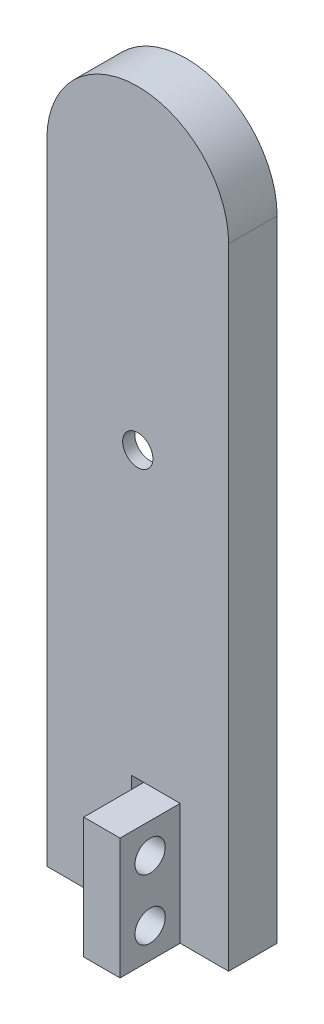
ISO-10303-21;
HEADER;
FILE_DESCRIPTION(('STEP AP214'),'2;1');
FILE_NAME('part.step','',(''),(''),'','','');
FILE_SCHEMA(('AUTOMOTIVE_DESIGN { 1 0 10303 214 1 1 1 1 }'));
ENDSEC;
DATA;
#1=APPLICATION_CONTEXT('core data for automotive mechanical design processes');
#2=APPLICATION_PROTOCOL_DEFINITION('international standard','automotive_design',2000,#1);
#3=PRODUCT_CONTEXT('',#1,'mechanical');
#4=PRODUCT('Part','Part','',(#3));
#5=PRODUCT_RELATED_PRODUCT_CATEGORY('part','',(#4));
#6=PRODUCT_DEFINITION_FORMATION('','',#4);
#7=PRODUCT_DEFINITION_CONTEXT('part definition',#1,'design');
#8=PRODUCT_DEFINITION('design','',#6,#7);
#9=PRODUCT_DEFINITION_SHAPE('','',#8);
#10=(LENGTH_UNIT() NAMED_UNIT(*) SI_UNIT(.MILLI.,.METRE.));
#11=(NAMED_UNIT(*) PLANE_ANGLE_UNIT() SI_UNIT($,.RADIAN.));
#12=(NAMED_UNIT(*) SI_UNIT($,.STERADIAN.) SOLID_ANGLE_UNIT());
#13=UNCERTAINTY_MEASURE_WITH_UNIT(LENGTH_MEASURE(1.E-05),#10,'distance_accuracy_value','');
#14=(GEOMETRIC_REPRESENTATION_CONTEXT(3) GLOBAL_UNCERTAINTY_ASSIGNED_CONTEXT((#13)) GLOBAL_UNIT_ASSIGNED_CONTEXT((#10,
#11,#12)) REPRESENTATION_CONTEXT('',''));
#15=CARTESIAN_POINT('',(0.,0.,0.));
#16=DIRECTION('',(0.,0.,1.));
#17=DIRECTION('',(1.,0.,0.));
#18=AXIS2_PLACEMENT_3D('',#15,#16,#17);
#19=CARTESIAN_POINT('',(0.,52.,4.));
#20=DIRECTION('',(0.,0.,1.));
#21=DIRECTION('',(1.,0.,0.));
#22=AXIS2_PLACEMENT_3D('',#19,#20,#21);
#23=PLANE('',#22);
#24=CARTESIAN_POINT('',(0.,33.5,4.));
#25=DIRECTION('',(0.,0.,1.));
#26=DIRECTION('',(1.,0.,0.));
#27=AXIS2_PLACEMENT_3D('',#24,#25,#26);
#28=CIRCLE('',#27,1.25);
#29=CARTESIAN_POINT('',(1.25,33.5,4.));
#30=VERTEX_POINT('',#29);
#31=EDGE_CURVE('E219',#30,#30,#28,.F.);
#32=ORIENTED_EDGE('',*,*,#31,.T.);
#33=EDGE_LOOP('',(#32));
#34=FACE_BOUND('',#33,.T.);
#35=DIRECTION('',(1.,0.,0.));
#36=VECTOR('',#35,1.);
#37=CARTESIAN_POINT('',(0.,10.,4.));
#38=LINE('',#37,#36);
#39=CARTESIAN_POINT('',(-0.499999999999999,10.,4.));
#40=VERTEX_POINT('',#39);
#41=CARTESIAN_POINT('',(0.499999999999999,10.,4.));
#42=VERTEX_POINT('',#41);
#43=EDGE_CURVE('E215',#40,#42,#38,.T.);
#44=ORIENTED_EDGE('',*,*,#43,.T.);
#45=DIRECTION('',(1.,0.,0.));
#46=VECTOR('',#45,1.);
#47=CARTESIAN_POINT('',(0.,10.,4.));
#48=LINE('',#47,#46);
#49=CARTESIAN_POINT('',(3.5,10.,4.));
#50=VERTEX_POINT('',#49);
#51=EDGE_CURVE('E56',#42,#50,#48,.T.);
#52=ORIENTED_EDGE('',*,*,#51,.T.);
#53=DIRECTION('',(0.,1.,0.));
#54=VECTOR('',#53,1.);
#55=CARTESIAN_POINT('',(3.5,52.,4.));
#56=LINE('',#55,#54);
#57=CARTESIAN_POINT('',(3.5,0.,4.));
#58=VERTEX_POINT('',#57);
#59=EDGE_CURVE('E11',#58,#50,#56,.T.);
#60=ORIENTED_EDGE('',*,*,#59,.F.);
#61=DIRECTION('',(1.,0.,0.));
#62=VECTOR('',#61,1.);
#63=CARTESIAN_POINT('',(7.5,0.,4.));
#64=LINE('',#63,#62);
#65=CARTESIAN_POINT('',(7.5,0.,4.));
#66=VERTEX_POINT('',#65);
#67=EDGE_CURVE('E160',#58,#66,#64,.T.);
#68=ORIENTED_EDGE('',*,*,#67,.T.);
#69=DIRECTION('',(0.,1.,0.));
#70=VECTOR('',#69,1.);
#71=CARTESIAN_POINT('',(7.5,0.,4.));
#72=LINE('',#71,#70);
#73=CARTESIAN_POINT('',(7.5,52.,4.));
#74=VERTEX_POINT('',#73);
#75=EDGE_CURVE('E290',#66,#74,#72,.T.);
#76=ORIENTED_EDGE('',*,*,#75,.T.);
#77=CARTESIAN_POINT('',(0.,52.,4.));
#78=DIRECTION('',(0.,0.,1.));
#79=DIRECTION('',(1.,0.,0.));
#80=AXIS2_PLACEMENT_3D('',#77,#78,#79);
#81=CIRCLE('',#80,7.5);
#82=CARTESIAN_POINT('',(-7.5,52.,4.));
#83=VERTEX_POINT('',#82);
#84=EDGE_CURVE('E293',#74,#83,#81,.T.);
#85=ORIENTED_EDGE('',*,*,#84,.T.);
#86=DIRECTION('',(0.,-1.,0.));
#87=VECTOR('',#86,1.);
#88=CARTESIAN_POINT('',(-7.5,0.,4.));
#89=LINE('',#88,#87);
#90=CARTESIAN_POINT('',(-7.5,0.,4.));
#91=VERTEX_POINT('',#90);
#92=EDGE_CURVE('E296',#83,#91,#89,.T.);
#93=ORIENTED_EDGE('',*,*,#92,.T.);
#94=CARTESIAN_POINT('',(-0.5,0.,4.));
#95=VERTEX_POINT('',#94);
#96=EDGE_CURVE('E286',#91,#95,#64,.T.);
#97=ORIENTED_EDGE('',*,*,#96,.T.);
#98=DIRECTION('',(0.,1.,0.));
#99=VECTOR('',#98,1.);
#100=CARTESIAN_POINT('',(-0.499999999999997,52.,4.));
#101=LINE('',#100,#99);
#102=EDGE_CURVE('E211',#95,#40,#101,.T.);
#103=ORIENTED_EDGE('',*,*,#102,.T.);
#104=EDGE_LOOP('',(#44,#52,#60,#68,#76,#85,#93,#97,#103));
#105=FACE_BOUND('',#104,.T.);
#106=ADVANCED_FACE('F38',(#34,#105),#23,.T.);
#107=CARTESIAN_POINT('',(7.5,0.,4.));
#108=DIRECTION('',(0.,1.,0.));
#109=DIRECTION('',(0.,0.,1.));
#110=AXIS2_PLACEMENT_3D('',#107,#108,#109);
#111=PLANE('',#110);
#112=DIRECTION('',(0.,0.,-1.));
#113=VECTOR('',#112,1.);
#114=CARTESIAN_POINT('',(0.5,0.,16.3));
#115=LINE('',#114,#113);
#116=CARTESIAN_POINT('',(0.5,0.,8.96178465974861));
#117=VERTEX_POINT('',#116);
#118=CARTESIAN_POINT('',(0.5,0.,0.));
#119=VERTEX_POINT('',#118);
#120=EDGE_CURVE('E208',#117,#119,#115,.T.);
#121=ORIENTED_EDGE('',*,*,#120,.T.);
#122=DIRECTION('',(1.,0.,0.));
#123=VECTOR('',#122,1.);
#124=CARTESIAN_POINT('',(7.5,0.,0.));
#125=LINE('',#124,#123);
#126=CARTESIAN_POINT('',(7.5,0.,0.));
#127=VERTEX_POINT('',#126);
#128=EDGE_CURVE('E285',#119,#127,#125,.T.);
#129=ORIENTED_EDGE('',*,*,#128,.T.);
#130=DIRECTION('',(0.,0.,-1.));
#131=VECTOR('',#130,1.);
#132=CARTESIAN_POINT('',(7.5,0.,4.));
#133=LINE('',#132,#131);
#134=EDGE_CURVE('E48',#66,#127,#133,.T.);
#135=ORIENTED_EDGE('',*,*,#134,.F.);
#136=ORIENTED_EDGE('',*,*,#67,.F.);
#137=DIRECTION('',(0.,0.,-1.));
#138=VECTOR('',#137,1.);
#139=CARTESIAN_POINT('',(3.5,0.,8.96178465974861));
#140=LINE('',#139,#138);
#141=CARTESIAN_POINT('',(3.5,0.,8.96178465974861));
#142=VERTEX_POINT('',#141);
#143=EDGE_CURVE('E154',#142,#58,#140,.T.);
#144=ORIENTED_EDGE('',*,*,#143,.F.);
#145=DIRECTION('',(-1.,0.,0.));
#146=VECTOR('',#145,1.);
#147=CARTESIAN_POINT('',(3.5,0.,8.96178465974861));
#148=LINE('',#147,#146);
#149=EDGE_CURVE('E157',#142,#117,#148,.T.);
#150=ORIENTED_EDGE('',*,*,#149,.T.);
#151=EDGE_LOOP('',(#121,#129,#135,#136,#144,#150));
#152=FACE_BOUND('',#151,.T.);
#153=ADVANCED_FACE('F40',(#152),#111,.F.);
#154=DIRECTION('',(0.,0.,-1.));
#155=VECTOR('',#154,1.);
#156=CARTESIAN_POINT('',(-0.5,0.,16.3));
#157=LINE('',#156,#155);
#158=CARTESIAN_POINT('',(-0.499999999999999,0.,0.));
#159=VERTEX_POINT('',#158);
#160=EDGE_CURVE('E199',#95,#159,#157,.T.);
#161=ORIENTED_EDGE('',*,*,#160,.F.);
#162=ORIENTED_EDGE('',*,*,#96,.F.);
#163=DIRECTION('',(0.,0.,-1.));
#164=VECTOR('',#163,1.);
#165=CARTESIAN_POINT('',(-7.5,0.,4.));
#166=LINE('',#165,#164);
#167=CARTESIAN_POINT('',(-7.5,0.,0.));
#168=VERTEX_POINT('',#167);
#169=EDGE_CURVE('E299',#91,#168,#166,.T.);
#170=ORIENTED_EDGE('',*,*,#169,.T.);
#171=EDGE_CURVE('E300',#168,#159,#125,.T.);
#172=ORIENTED_EDGE('',*,*,#171,.T.);
#173=EDGE_LOOP('',(#161,#162,#170,#172));
#174=FACE_BOUND('',#173,.T.);
#175=ADVANCED_FACE('F381',(#174),#111,.F.);
#176=CARTESIAN_POINT('',(0.,52.,0.));
#177=DIRECTION('',(0.,0.,1.));
#178=DIRECTION('',(1.,0.,0.));
#179=AXIS2_PLACEMENT_3D('',#176,#177,#178);
#180=PLANE('',#179);
#181=DIRECTION('',(-0.161684528353419,0.986842496699008,0.));
#182=VECTOR('',#181,1.);
#183=CARTESIAN_POINT('',(10.214455548325,1.67353902293652,0.));
#184=LINE('',#183,#182);
#185=CARTESIAN_POINT('',(5.,33.5,0.));
#186=VERTEX_POINT('',#185);
#187=CARTESIAN_POINT('',(2.5,48.7587651204003,0.));
#188=VERTEX_POINT('',#187);
#189=EDGE_CURVE('E229',#186,#188,#184,.T.);
#190=ORIENTED_EDGE('',*,*,#189,.T.);
#191=CARTESIAN_POINT('',(0.,48.7587651204003,0.));
#192=DIRECTION('',(0.,0.,1.));
#193=DIRECTION('',(1.,0.,0.));
#194=AXIS2_PLACEMENT_3D('',#191,#192,#193);
#195=CIRCLE('',#194,2.5);
#196=CARTESIAN_POINT('',(-2.5,48.7587651204003,0.));
#197=VERTEX_POINT('',#196);
#198=EDGE_CURVE('E223',#197,#188,#195,.F.);
#199=ORIENTED_EDGE('',*,*,#198,.F.);
#200=DIRECTION('',(-0.161684528353419,-0.986842496699008,0.));
#201=VECTOR('',#200,1.);
#202=CARTESIAN_POINT('',(-10.214455548325,1.67353902293652,0.));
#203=LINE('',#202,#201);
#204=CARTESIAN_POINT('',(-5.,33.5,0.));
#205=VERTEX_POINT('',#204);
#206=EDGE_CURVE('E248',#197,#205,#203,.T.);
#207=ORIENTED_EDGE('',*,*,#206,.T.);
#208=DIRECTION('',(0.161684528353559,-0.986842496698985,0.));
#209=VECTOR('',#208,1.);
#210=CARTESIAN_POINT('',(0.475874415418367,0.0779673865584585,0.));
#211=LINE('',#210,#209);
#212=CARTESIAN_POINT('',(-2.49999999999778,18.2412348795997,0.));
#213=VERTEX_POINT('',#212);
#214=EDGE_CURVE('E252',#205,#213,#211,.T.);
#215=ORIENTED_EDGE('',*,*,#214,.T.);
#216=CARTESIAN_POINT('',(0.,18.2412348795997,0.));
#217=DIRECTION('',(0.,0.,1.));
#218=DIRECTION('',(1.,0.,0.));
#219=AXIS2_PLACEMENT_3D('',#216,#217,#218);
#220=CIRCLE('',#219,2.49999999999778);
#221=CARTESIAN_POINT('',(2.46793907135045,17.8421399784913,0.));
#222=VERTEX_POINT('',#221);
#223=EDGE_CURVE('E256',#213,#222,#220,.T.);
#224=ORIENTED_EDGE('',*,*,#223,.T.);
#225=DIRECTION('',(-0.159637960443526,-0.987175628541057,0.));
#226=VECTOR('',#225,1.);
#227=CARTESIAN_POINT('',(-0.40670997405781,0.0657698071888002,0.));
#228=LINE('',#227,#226);
#229=EDGE_CURVE('E260',#186,#222,#228,.T.);
#230=ORIENTED_EDGE('',*,*,#229,.F.);
#231=EDGE_LOOP('',(#190,#199,#207,#215,#224,#230));
#232=FACE_BOUND('',#231,.T.);
#233=DIRECTION('',(0.,1.,0.));
#234=VECTOR('',#233,1.);
#235=CARTESIAN_POINT('',(0.5,0.,0.));
#236=LINE('',#235,#234);
#237=CARTESIAN_POINT('',(0.499999999999999,10.,0.));
#238=VERTEX_POINT('',#237);
#239=EDGE_CURVE('E183',#119,#238,#236,.T.);
#240=ORIENTED_EDGE('',*,*,#239,.T.);
#241=DIRECTION('',(-1.,0.,0.));
#242=VECTOR('',#241,1.);
#243=CARTESIAN_POINT('',(0.499999999999999,10.,0.));
#244=LINE('',#243,#242);
#245=CARTESIAN_POINT('',(-0.499999999999999,10.,0.));
#246=VERTEX_POINT('',#245);
#247=EDGE_CURVE('E191',#238,#246,#244,.T.);
#248=ORIENTED_EDGE('',*,*,#247,.T.);
#249=DIRECTION('',(0.,-1.,0.));
#250=VECTOR('',#249,1.);
#251=CARTESIAN_POINT('',(-0.5,0.,0.));
#252=LINE('',#251,#250);
#253=EDGE_CURVE('E195',#246,#159,#252,.T.);
#254=ORIENTED_EDGE('',*,*,#253,.T.);
#255=ORIENTED_EDGE('',*,*,#171,.F.);
#256=DIRECTION('',(0.,-1.,0.));
#257=VECTOR('',#256,1.);
#258=CARTESIAN_POINT('',(-7.5,0.,0.));
#259=LINE('',#258,#257);
#260=CARTESIAN_POINT('',(-7.5,52.,0.));
#261=VERTEX_POINT('',#260);
#262=EDGE_CURVE('E310',#261,#168,#259,.T.);
#263=ORIENTED_EDGE('',*,*,#262,.F.);
#264=CARTESIAN_POINT('',(0.,52.,0.));
#265=DIRECTION('',(0.,0.,1.));
#266=DIRECTION('',(1.,0.,0.));
#267=AXIS2_PLACEMENT_3D('',#264,#265,#266);
#268=CIRCLE('',#267,7.5);
#269=CARTESIAN_POINT('',(7.5,52.,0.));
#270=VERTEX_POINT('',#269);
#271=EDGE_CURVE('E307',#270,#261,#268,.T.);
#272=ORIENTED_EDGE('',*,*,#271,.F.);
#273=DIRECTION('',(0.,1.,0.));
#274=VECTOR('',#273,1.);
#275=CARTESIAN_POINT('',(7.5,0.,0.));
#276=LINE('',#275,#274);
#277=EDGE_CURVE('E304',#127,#270,#276,.T.);
#278=ORIENTED_EDGE('',*,*,#277,.F.);
#279=ORIENTED_EDGE('',*,*,#128,.F.);
#280=EDGE_LOOP('',(#240,#248,#254,#255,#263,#272,#278,#279));
#281=FACE_BOUND('',#280,.T.);
#282=ADVANCED_FACE('F362',(#232,#281),#180,.F.);
#283=CARTESIAN_POINT('',(7.5,0.,4.));
#284=DIRECTION('',(-1.,0.,0.));
#285=DIRECTION('',(0.,0.,1.));
#286=AXIS2_PLACEMENT_3D('',#283,#284,#285);
#287=PLANE('',#286);
#288=ORIENTED_EDGE('',*,*,#277,.T.);
#289=DIRECTION('',(0.,0.,-1.));
#290=VECTOR('',#289,1.);
#291=CARTESIAN_POINT('',(7.5,52.,4.));
#292=LINE('',#291,#290);
#293=EDGE_CURVE('E320',#74,#270,#292,.T.);
#294=ORIENTED_EDGE('',*,*,#293,.F.);
#295=ORIENTED_EDGE('',*,*,#75,.F.);
#296=ORIENTED_EDGE('',*,*,#134,.T.);
#297=EDGE_LOOP('',(#288,#294,#295,#296));
#298=FACE_BOUND('',#297,.T.);
#299=ADVANCED_FACE('F367',(#298),#287,.F.);
#300=CARTESIAN_POINT('',(0.,52.,4.));
#301=DIRECTION('',(0.,0.,-1.));
#302=DIRECTION('',(-1.,0.,0.));
#303=AXIS2_PLACEMENT_3D('',#300,#301,#302);
#304=CYLINDRICAL_SURFACE('',#303,7.5);
#305=ORIENTED_EDGE('',*,*,#271,.T.);
#306=DIRECTION('',(0.,0.,-1.));
#307=VECTOR('',#306,1.);
#308=CARTESIAN_POINT('',(-7.5,52.,4.));
#309=LINE('',#308,#307);
#310=EDGE_CURVE('E316',#83,#261,#309,.T.);
#311=ORIENTED_EDGE('',*,*,#310,.F.);
#312=ORIENTED_EDGE('',*,*,#84,.F.);
#313=ORIENTED_EDGE('',*,*,#293,.T.);
#314=EDGE_LOOP('',(#305,#311,#312,#313));
#315=FACE_BOUND('',#314,.T.);
#316=ADVANCED_FACE('F374',(#315),#304,.T.);
#317=CARTESIAN_POINT('',(-7.5,0.,4.));
#318=DIRECTION('',(1.,0.,0.));
#319=DIRECTION('',(0.,0.,-1.));
#320=AXIS2_PLACEMENT_3D('',#317,#318,#319);
#321=PLANE('',#320);
#322=ORIENTED_EDGE('',*,*,#262,.T.);
#323=ORIENTED_EDGE('',*,*,#169,.F.);
#324=ORIENTED_EDGE('',*,*,#92,.F.);
#325=ORIENTED_EDGE('',*,*,#310,.T.);
#326=EDGE_LOOP('',(#322,#323,#324,#325));
#327=FACE_BOUND('',#326,.T.);
#328=ADVANCED_FACE('F376',(#327),#321,.F.);
#329=CARTESIAN_POINT('',(0.,48.7587651204003,3.));
#330=DIRECTION('',(0.,0.,-1.));
#331=DIRECTION('',(-1.,0.,0.));
#332=AXIS2_PLACEMENT_3D('',#329,#330,#331);
#333=CYLINDRICAL_SURFACE('',#332,2.5);
#334=ORIENTED_EDGE('',*,*,#198,.T.);
#335=DIRECTION('',(0.,0.,-1.));
#336=VECTOR('',#335,1.);
#337=CARTESIAN_POINT('',(2.5,48.7587651204003,3.));
#338=LINE('',#337,#336);
#339=CARTESIAN_POINT('',(2.5,48.7587651204003,3.));
#340=VERTEX_POINT('',#339);
#341=EDGE_CURVE('E245',#340,#188,#338,.T.);
#342=ORIENTED_EDGE('',*,*,#341,.F.);
#343=CARTESIAN_POINT('',(0.,48.7587651204003,3.));
#344=DIRECTION('',(0.,0.,1.));
#345=DIRECTION('',(1.,0.,0.));
#346=AXIS2_PLACEMENT_3D('',#343,#344,#345);
#347=CIRCLE('',#346,2.5);
#348=CARTESIAN_POINT('',(-2.5,48.7587651204003,3.));
#349=VERTEX_POINT('',#348);
#350=EDGE_CURVE('E224',#349,#340,#347,.F.);
#351=ORIENTED_EDGE('',*,*,#350,.F.);
#352=DIRECTION('',(0.,0.,-1.));
#353=VECTOR('',#352,1.);
#354=CARTESIAN_POINT('',(-2.5,48.7587651204003,3.));
#355=LINE('',#354,#353);
#356=EDGE_CURVE('E282',#349,#197,#355,.T.);
#357=ORIENTED_EDGE('',*,*,#356,.T.);
#358=EDGE_LOOP('',(#334,#342,#351,#357));
#359=FACE_BOUND('',#358,.T.);
#360=ADVANCED_FACE('F406',(#359),#333,.F.);
#361=CARTESIAN_POINT('',(-10.214455548325,1.67353902293652,3.));
#362=DIRECTION('',(0.986842496699008,-0.161684528353419,0.));
#363=DIRECTION('',(0.161684528353419,0.986842496699008,0.));
#364=AXIS2_PLACEMENT_3D('',#361,#362,#363);
#365=PLANE('',#364);
#366=ORIENTED_EDGE('',*,*,#206,.F.);
#367=ORIENTED_EDGE('',*,*,#356,.F.);
#368=DIRECTION('',(-0.161684528353419,-0.986842496699008,0.));
#369=VECTOR('',#368,1.);
#370=CARTESIAN_POINT('',(-10.214455548325,1.67353902293652,3.));
#371=LINE('',#370,#369);
#372=CARTESIAN_POINT('',(-5.,33.5,3.));
#373=VERTEX_POINT('',#372);
#374=EDGE_CURVE('E228',#349,#373,#371,.T.);
#375=ORIENTED_EDGE('',*,*,#374,.T.);
#376=DIRECTION('',(0.,0.,-1.));
#377=VECTOR('',#376,1.);
#378=CARTESIAN_POINT('',(-5.,33.5,3.));
#379=LINE('',#378,#377);
#380=EDGE_CURVE('E279',#373,#205,#379,.T.);
#381=ORIENTED_EDGE('',*,*,#380,.T.);
#382=EDGE_LOOP('',(#366,#367,#375,#381));
#383=FACE_BOUND('',#382,.T.);
#384=ADVANCED_FACE('F434',(#383),#365,.T.);
#385=CARTESIAN_POINT('',(0.475874415418367,0.0779673865584585,3.));
#386=DIRECTION('',(0.986842496698985,0.161684528353559,0.));
#387=DIRECTION('',(-0.161684528353559,0.986842496698985,0.));
#388=AXIS2_PLACEMENT_3D('',#385,#386,#387);
#389=PLANE('',#388);
#390=ORIENTED_EDGE('',*,*,#214,.F.);
#391=ORIENTED_EDGE('',*,*,#380,.F.);
#392=DIRECTION('',(0.161684528353559,-0.986842496698985,0.));
#393=VECTOR('',#392,1.);
#394=CARTESIAN_POINT('',(0.475874415418367,0.0779673865584585,3.));
#395=LINE('',#394,#393);
#396=CARTESIAN_POINT('',(-2.49999999999778,18.2412348795997,3.));
#397=VERTEX_POINT('',#396);
#398=EDGE_CURVE('E232',#373,#397,#395,.T.);
#399=ORIENTED_EDGE('',*,*,#398,.T.);
#400=DIRECTION('',(0.,0.,-1.));
#401=VECTOR('',#400,1.);
#402=CARTESIAN_POINT('',(-2.49999999999778,18.2412348795997,3.));
#403=LINE('',#402,#401);
#404=EDGE_CURVE('E276',#397,#213,#403,.T.);
#405=ORIENTED_EDGE('',*,*,#404,.T.);
#406=EDGE_LOOP('',(#390,#391,#399,#405));
#407=FACE_BOUND('',#406,.T.);
#408=ADVANCED_FACE('F441',(#407),#389,.T.);
#409=CARTESIAN_POINT('',(0.,18.2412348795997,3.));
#410=DIRECTION('',(0.,0.,-1.));
#411=DIRECTION('',(-1.,0.,0.));
#412=AXIS2_PLACEMENT_3D('',#409,#410,#411);
#413=CYLINDRICAL_SURFACE('',#412,2.49999999999778);
#414=ORIENTED_EDGE('',*,*,#223,.F.);
#415=ORIENTED_EDGE('',*,*,#404,.F.);
#416=CARTESIAN_POINT('',(0.,18.2412348795997,3.));
#417=DIRECTION('',(0.,0.,1.));
#418=DIRECTION('',(1.,0.,0.));
#419=AXIS2_PLACEMENT_3D('',#416,#417,#418);
#420=CIRCLE('',#419,2.49999999999778);
#421=CARTESIAN_POINT('',(2.46793907135045,17.8421399784913,3.));
#422=VERTEX_POINT('',#421);
#423=EDGE_CURVE('E235',#397,#422,#420,.T.);
#424=ORIENTED_EDGE('',*,*,#423,.T.);
#425=DIRECTION('',(0.,0.,-1.));
#426=VECTOR('',#425,1.);
#427=CARTESIAN_POINT('',(2.46793907135045,17.8421399784913,3.));
#428=LINE('',#427,#426);
#429=EDGE_CURVE('E273',#422,#222,#428,.T.);
#430=ORIENTED_EDGE('',*,*,#429,.T.);
#431=EDGE_LOOP('',(#414,#415,#424,#430));
#432=FACE_BOUND('',#431,.T.);
#433=ADVANCED_FACE('F448',(#432),#413,.F.);
#434=CARTESIAN_POINT('',(-0.40670997405781,0.0657698071888002,3.));
#435=DIRECTION('',(0.987175628541057,-0.159637960443526,0.));
#436=DIRECTION('',(0.159637960443526,0.987175628541057,0.));
#437=AXIS2_PLACEMENT_3D('',#434,#435,#436);
#438=PLANE('',#437);
#439=ORIENTED_EDGE('',*,*,#229,.T.);
#440=ORIENTED_EDGE('',*,*,#429,.F.);
#441=DIRECTION('',(-0.159637960443526,-0.987175628541057,0.));
#442=VECTOR('',#441,1.);
#443=CARTESIAN_POINT('',(-0.40670997405781,0.0657698071888002,3.));
#444=LINE('',#443,#442);
#445=CARTESIAN_POINT('',(5.,33.5,3.));
#446=VERTEX_POINT('',#445);
#447=EDGE_CURVE('E238',#446,#422,#444,.T.);
#448=ORIENTED_EDGE('',*,*,#447,.F.);
#449=DIRECTION('',(0.,0.,-1.));
#450=VECTOR('',#449,1.);
#451=CARTESIAN_POINT('',(5.,33.5,3.));
#452=LINE('',#451,#450);
#453=EDGE_CURVE('E270',#446,#186,#452,.T.);
#454=ORIENTED_EDGE('',*,*,#453,.T.);
#455=EDGE_LOOP('',(#439,#440,#448,#454));
#456=FACE_BOUND('',#455,.T.);
#457=ADVANCED_FACE('F456',(#456),#438,.F.);
#458=CARTESIAN_POINT('',(10.214455548325,1.67353902293652,3.));
#459=DIRECTION('',(-0.986842496699008,-0.161684528353419,0.));
#460=DIRECTION('',(0.161684528353419,-0.986842496699008,0.));
#461=AXIS2_PLACEMENT_3D('',#458,#459,#460);
#462=PLANE('',#461);
#463=ORIENTED_EDGE('',*,*,#189,.F.);
#464=ORIENTED_EDGE('',*,*,#453,.F.);
#465=DIRECTION('',(-0.161684528353419,0.986842496699008,0.));
#466=VECTOR('',#465,1.);
#467=CARTESIAN_POINT('',(10.214455548325,1.67353902293652,3.));
#468=LINE('',#467,#466);
#469=EDGE_CURVE('E242',#446,#340,#468,.T.);
#470=ORIENTED_EDGE('',*,*,#469,.T.);
#471=ORIENTED_EDGE('',*,*,#341,.T.);
#472=EDGE_LOOP('',(#463,#464,#470,#471));
#473=FACE_BOUND('',#472,.T.);
#474=ADVANCED_FACE('F464',(#473),#462,.T.);
#475=CARTESIAN_POINT('',(0.,0.,3.));
#476=DIRECTION('',(0.,0.,1.));
#477=DIRECTION('',(1.,0.,0.));
#478=AXIS2_PLACEMENT_3D('',#475,#476,#477);
#479=PLANE('',#478);
#480=CARTESIAN_POINT('',(0.,33.5,3.));
#481=DIRECTION('',(0.,0.,1.));
#482=DIRECTION('',(1.,0.,0.));
#483=AXIS2_PLACEMENT_3D('',#480,#481,#482);
#484=CIRCLE('',#483,1.25);
#485=CARTESIAN_POINT('',(1.25,33.5,3.));
#486=VERTEX_POINT('',#485);
#487=EDGE_CURVE('E218',#486,#486,#484,.F.);
#488=ORIENTED_EDGE('',*,*,#487,.F.);
#489=EDGE_LOOP('',(#488));
#490=FACE_BOUND('',#489,.T.);
#491=ORIENTED_EDGE('',*,*,#350,.T.);
#492=ORIENTED_EDGE('',*,*,#469,.F.);
#493=ORIENTED_EDGE('',*,*,#447,.T.);
#494=ORIENTED_EDGE('',*,*,#423,.F.);
#495=ORIENTED_EDGE('',*,*,#398,.F.);
#496=ORIENTED_EDGE('',*,*,#374,.F.);
#497=EDGE_LOOP('',(#491,#492,#493,#494,#495,#496));
#498=FACE_BOUND('',#497,.T.);
#499=ADVANCED_FACE('F472',(#490,#498),#479,.F.);
#500=CARTESIAN_POINT('',(0.,33.5,12.4));
#501=DIRECTION('',(0.,0.,-1.));
#502=DIRECTION('',(-1.,0.,0.));
#503=AXIS2_PLACEMENT_3D('',#500,#501,#502);
#504=CYLINDRICAL_SURFACE('',#503,1.25);
#505=ORIENTED_EDGE('',*,*,#31,.F.);
#506=EDGE_LOOP('',(#505));
#507=FACE_BOUND('',#506,.T.);
#508=ORIENTED_EDGE('',*,*,#487,.T.);
#509=EDGE_LOOP('',(#508));
#510=FACE_BOUND('',#509,.T.);
#511=ADVANCED_FACE('F396',(#507,#510),#504,.F.);
#512=CARTESIAN_POINT('',(0.5,0.,16.3));
#513=DIRECTION('',(-1.,0.,0.));
#514=DIRECTION('',(0.,-1.,0.));
#515=AXIS2_PLACEMENT_3D('',#512,#513,#514);
#516=PLANE('',#515);
#517=CARTESIAN_POINT('',(0.5,7.5,6.48089232987431));
#518=DIRECTION('',(1.,0.,0.));
#519=DIRECTION('',(0.,0.,-1.));
#520=AXIS2_PLACEMENT_3D('',#517,#518,#519);
#521=CIRCLE('',#520,1.25);
#522=CARTESIAN_POINT('',(0.5,7.5,5.23089232987431));
#523=VERTEX_POINT('',#522);
#524=EDGE_CURVE('E332',#523,#523,#521,.T.);
#525=ORIENTED_EDGE('',*,*,#524,.T.);
#526=EDGE_LOOP('',(#525));
#527=FACE_BOUND('',#526,.T.);
#528=CARTESIAN_POINT('',(0.5,2.5,6.48089232987431));
#529=DIRECTION('',(1.,0.,0.));
#530=DIRECTION('',(0.,0.,1.));
#531=AXIS2_PLACEMENT_3D('',#528,#529,#530);
#532=CIRCLE('',#531,1.25);
#533=CARTESIAN_POINT('',(0.5,2.5,7.73089232987431));
#534=VERTEX_POINT('',#533);
#535=EDGE_CURVE('E339',#534,#534,#532,.T.);
#536=ORIENTED_EDGE('',*,*,#535,.T.);
#537=EDGE_LOOP('',(#536));
#538=FACE_BOUND('',#537,.T.);
#539=DIRECTION('',(0.,0.,-1.));
#540=VECTOR('',#539,1.);
#541=CARTESIAN_POINT('',(0.499999999999999,10.,16.3));
#542=LINE('',#541,#540);
#543=EDGE_CURVE('E205',#42,#238,#542,.T.);
#544=ORIENTED_EDGE('',*,*,#543,.T.);
#545=ORIENTED_EDGE('',*,*,#239,.F.);
#546=ORIENTED_EDGE('',*,*,#120,.F.);
#547=DIRECTION('',(0.,-1.,0.));
#548=VECTOR('',#547,1.);
#549=CARTESIAN_POINT('',(0.5,10.,8.96178465974861));
#550=LINE('',#549,#548);
#551=CARTESIAN_POINT('',(0.5,10.,8.96178465974861));
#552=VERTEX_POINT('',#551);
#553=EDGE_CURVE('E177',#552,#117,#550,.T.);
#554=ORIENTED_EDGE('',*,*,#553,.F.);
#555=DIRECTION('',(0.,0.,1.));
#556=VECTOR('',#555,1.);
#557=CARTESIAN_POINT('',(0.5,10.,8.96178465974861));
#558=LINE('',#557,#556);
#559=EDGE_CURVE('E173',#42,#552,#558,.T.);
#560=ORIENTED_EDGE('',*,*,#559,.F.);
#561=EDGE_LOOP('',(#544,#545,#546,#554,#560));
#562=FACE_BOUND('',#561,.T.);
#563=ADVANCED_FACE('F355',(#527,#538,#562),#516,.T.);
#564=CARTESIAN_POINT('',(0.499999999999999,10.,16.3));
#565=DIRECTION('',(0.,-1.,0.));
#566=DIRECTION('',(0.,0.,-1.));
#567=AXIS2_PLACEMENT_3D('',#564,#565,#566);
#568=PLANE('',#567);
#569=DIRECTION('',(0.,0.,-1.));
#570=VECTOR('',#569,1.);
#571=CARTESIAN_POINT('',(-0.499999999999999,10.,16.3));
#572=LINE('',#571,#570);
#573=EDGE_CURVE('E202',#40,#246,#572,.T.);
#574=ORIENTED_EDGE('',*,*,#573,.T.);
#575=ORIENTED_EDGE('',*,*,#247,.F.);
#576=ORIENTED_EDGE('',*,*,#543,.F.);
#577=ORIENTED_EDGE('',*,*,#43,.F.);
#578=EDGE_LOOP('',(#574,#575,#576,#577));
#579=FACE_BOUND('',#578,.T.);
#580=ADVANCED_FACE('F388',(#579),#568,.T.);
#581=CARTESIAN_POINT('',(-0.5,0.,16.3));
#582=DIRECTION('',(1.,0.,0.));
#583=DIRECTION('',(0.,1.,0.));
#584=AXIS2_PLACEMENT_3D('',#581,#582,#583);
#585=PLANE('',#584);
#586=ORIENTED_EDGE('',*,*,#160,.T.);
#587=ORIENTED_EDGE('',*,*,#253,.F.);
#588=ORIENTED_EDGE('',*,*,#573,.F.);
#589=ORIENTED_EDGE('',*,*,#102,.F.);
#590=EDGE_LOOP('',(#586,#587,#588,#589));
#591=FACE_BOUND('',#590,.T.);
#592=ADVANCED_FACE('F384',(#591),#585,.T.);
#593=CARTESIAN_POINT('',(3.5,10.,8.96178465974861));
#594=DIRECTION('',(0.,0.,-1.));
#595=DIRECTION('',(-1.,0.,0.));
#596=AXIS2_PLACEMENT_3D('',#593,#594,#595);
#597=PLANE('',#596);
#598=ORIENTED_EDGE('',*,*,#553,.T.);
#599=ORIENTED_EDGE('',*,*,#149,.F.);
#600=DIRECTION('',(0.,-1.,0.));
#601=VECTOR('',#600,1.);
#602=CARTESIAN_POINT('',(3.5,10.,8.96178465974861));
#603=LINE('',#602,#601);
#604=CARTESIAN_POINT('',(3.5,10.,8.96178465974861));
#605=VERTEX_POINT('',#604);
#606=EDGE_CURVE('E164',#605,#142,#603,.T.);
#607=ORIENTED_EDGE('',*,*,#606,.F.);
#608=DIRECTION('',(-1.,0.,0.));
#609=VECTOR('',#608,1.);
#610=CARTESIAN_POINT('',(3.5,10.,8.96178465974861));
#611=LINE('',#610,#609);
#612=EDGE_CURVE('E179',#605,#552,#611,.T.);
#613=ORIENTED_EDGE('',*,*,#612,.T.);
#614=EDGE_LOOP('',(#598,#599,#607,#613));
#615=FACE_BOUND('',#614,.T.);
#616=ADVANCED_FACE('F175',(#615),#597,.F.);
#617=CARTESIAN_POINT('',(3.5,10.,8.96178465974861));
#618=DIRECTION('',(0.,-1.,0.));
#619=DIRECTION('',(0.,0.,-1.));
#620=AXIS2_PLACEMENT_3D('',#617,#618,#619);
#621=PLANE('',#620);
#622=ORIENTED_EDGE('',*,*,#51,.F.);
#623=ORIENTED_EDGE('',*,*,#559,.T.);
#624=ORIENTED_EDGE('',*,*,#612,.F.);
#625=DIRECTION('',(0.,0.,1.));
#626=VECTOR('',#625,1.);
#627=CARTESIAN_POINT('',(3.5,10.,8.96178465974861));
#628=LINE('',#627,#626);
#629=EDGE_CURVE('E163',#50,#605,#628,.T.);
#630=ORIENTED_EDGE('',*,*,#629,.F.);
#631=EDGE_LOOP('',(#622,#623,#624,#630));
#632=FACE_BOUND('',#631,.T.);
#633=ADVANCED_FACE('F353',(#632),#621,.F.);
#634=CARTESIAN_POINT('',(3.5,0.,0.));
#635=DIRECTION('',(1.,0.,0.));
#636=DIRECTION('',(0.,0.,-1.));
#637=AXIS2_PLACEMENT_3D('',#634,#635,#636);
#638=PLANE('',#637);
#639=CARTESIAN_POINT('',(3.5,7.5,6.48089232987431));
#640=DIRECTION('',(1.,0.,0.));
#641=DIRECTION('',(0.,0.,-1.));
#642=AXIS2_PLACEMENT_3D('',#639,#640,#641);
#643=CIRCLE('',#642,1.25);
#644=CARTESIAN_POINT('',(3.5,7.5,5.23089232987431));
#645=VERTEX_POINT('',#644);
#646=EDGE_CURVE('E42',#645,#645,#643,.F.);
#647=ORIENTED_EDGE('',*,*,#646,.T.);
#648=EDGE_LOOP('',(#647));
#649=FACE_BOUND('',#648,.T.);
#650=CARTESIAN_POINT('',(3.5,2.5,6.48089232987431));
#651=DIRECTION('',(1.,0.,0.));
#652=DIRECTION('',(0.,0.,-1.));
#653=AXIS2_PLACEMENT_3D('',#650,#651,#652);
#654=CIRCLE('',#653,1.25);
#655=CARTESIAN_POINT('',(3.5,2.5,5.23089232987431));
#656=VERTEX_POINT('',#655);
#657=EDGE_CURVE('E329',#656,#656,#654,.F.);
#658=ORIENTED_EDGE('',*,*,#657,.T.);
#659=EDGE_LOOP('',(#658));
#660=FACE_BOUND('',#659,.T.);
#661=ORIENTED_EDGE('',*,*,#143,.T.);
#662=ORIENTED_EDGE('',*,*,#59,.T.);
#663=ORIENTED_EDGE('',*,*,#629,.T.);
#664=ORIENTED_EDGE('',*,*,#606,.T.);
#665=EDGE_LOOP('',(#661,#662,#663,#664));
#666=FACE_BOUND('',#665,.T.);
#667=ADVANCED_FACE('F167',(#649,#660,#666),#638,.T.);
#668=CARTESIAN_POINT('',(5.6,2.5,6.48089232987431));
#669=DIRECTION('',(-1.,0.,0.));
#670=DIRECTION('',(0.,0.,1.));
#671=AXIS2_PLACEMENT_3D('',#668,#669,#670);
#672=CYLINDRICAL_SURFACE('',#671,1.25);
#673=ORIENTED_EDGE('',*,*,#657,.F.);
#674=EDGE_LOOP('',(#673));
#675=FACE_BOUND('',#674,.T.);
#676=ORIENTED_EDGE('',*,*,#535,.F.);
#677=EDGE_LOOP('',(#676));
#678=FACE_BOUND('',#677,.T.);
#679=ADVANCED_FACE('F510',(#675,#678),#672,.F.);
#680=CARTESIAN_POINT('',(5.6,7.5,6.48089232987431));
#681=DIRECTION('',(-1.,0.,0.));
#682=DIRECTION('',(0.,0.,1.));
#683=AXIS2_PLACEMENT_3D('',#680,#681,#682);
#684=CYLINDRICAL_SURFACE('',#683,1.25);
#685=ORIENTED_EDGE('',*,*,#646,.F.);
#686=EDGE_LOOP('',(#685));
#687=FACE_BOUND('',#686,.T.);
#688=ORIENTED_EDGE('',*,*,#524,.F.);
#689=EDGE_LOOP('',(#688));
#690=FACE_BOUND('',#689,.T.);
#691=ADVANCED_FACE('F520',(#687,#690),#684,.F.);
#692=CLOSED_SHELL('',(#106,#153,#175,#282,#299,#316,#328,#360,#384,#408,#433,#457,#474,#499,
#511,#563,#580,#592,#616,#633,#667,#679,#691));
#693=MANIFOLD_SOLID_BREP('B2',#692);
#694=ADVANCED_BREP_SHAPE_REPRESENTATION('',(#18,#693),#14);
#695=SHAPE_DEFINITION_REPRESENTATION(#9,#694);
ENDSEC;
END-ISO-10303-21;
